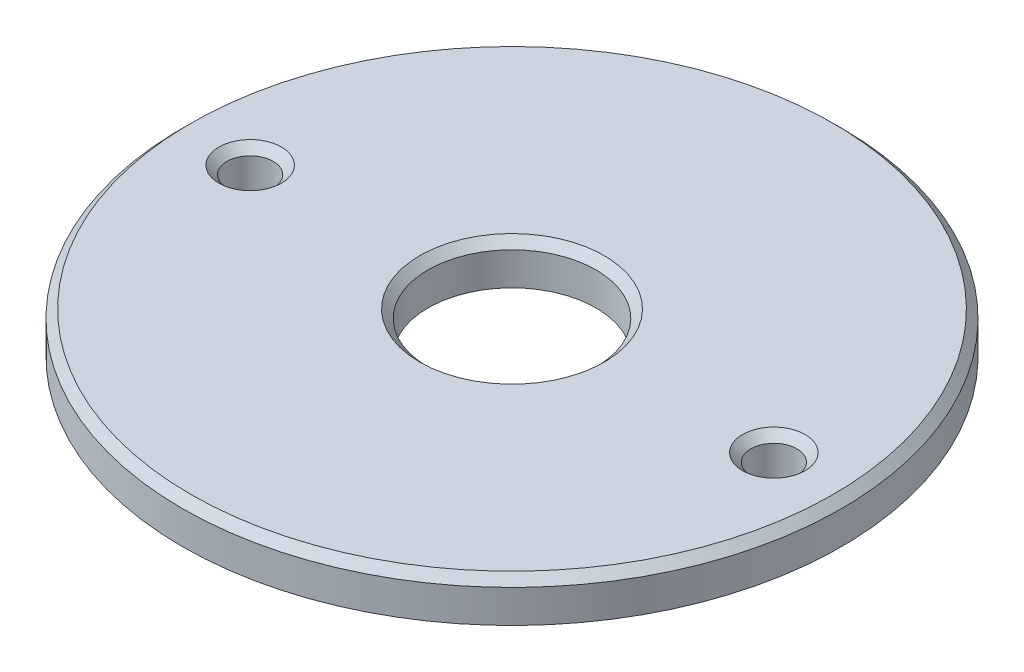
ISO-10303-21;
HEADER;
FILE_DESCRIPTION(('STEP AP214'),'2;1');
FILE_NAME('part.step','',(''),(''),'','','');
FILE_SCHEMA(('AUTOMOTIVE_DESIGN { 1 0 10303 214 1 1 1 1 }'));
ENDSEC;
DATA;
#1=APPLICATION_CONTEXT('core data for automotive mechanical design processes');
#2=APPLICATION_PROTOCOL_DEFINITION('international standard','automotive_design',2000,#1);
#3=PRODUCT_CONTEXT('',#1,'mechanical');
#4=PRODUCT('Part','Part','',(#3));
#5=PRODUCT_RELATED_PRODUCT_CATEGORY('part','',(#4));
#6=PRODUCT_DEFINITION_FORMATION('','',#4);
#7=PRODUCT_DEFINITION_CONTEXT('part definition',#1,'design');
#8=PRODUCT_DEFINITION('design','',#6,#7);
#9=PRODUCT_DEFINITION_SHAPE('','',#8);
#10=(LENGTH_UNIT() NAMED_UNIT(*) SI_UNIT(.MILLI.,.METRE.));
#11=(NAMED_UNIT(*) PLANE_ANGLE_UNIT() SI_UNIT($,.RADIAN.));
#12=(NAMED_UNIT(*) SI_UNIT($,.STERADIAN.) SOLID_ANGLE_UNIT());
#13=UNCERTAINTY_MEASURE_WITH_UNIT(LENGTH_MEASURE(1.E-05),#10,'distance_accuracy_value','');
#14=(GEOMETRIC_REPRESENTATION_CONTEXT(3) GLOBAL_UNCERTAINTY_ASSIGNED_CONTEXT((#13)) GLOBAL_UNIT_ASSIGNED_CONTEXT((#10,
#11,#12)) REPRESENTATION_CONTEXT('',''));
#15=CARTESIAN_POINT('',(0.,0.,0.));
#16=DIRECTION('',(0.,0.,1.));
#17=DIRECTION('',(1.,0.,0.));
#18=AXIS2_PLACEMENT_3D('',#15,#16,#17);
#19=CARTESIAN_POINT('',(0.,6.35,0.));
#20=DIRECTION('',(0.,1.,0.));
#21=DIRECTION('',(0.,0.,1.));
#22=AXIS2_PLACEMENT_3D('',#19,#20,#21);
#23=PLANE('',#22);
#24=CARTESIAN_POINT('',(39.37,6.35,-0.992258714812856));
#25=DIRECTION('',(0.,1.,0.));
#26=DIRECTION('',(0.,0.,1.));
#27=AXIS2_PLACEMENT_3D('',#24,#25,#26);
#28=CIRCLE('',#27,4.826);
#29=CARTESIAN_POINT('',(39.37,6.35,3.83374128518714));
#30=VERTEX_POINT('',#29);
#31=EDGE_CURVE('E57',#30,#30,#28,.F.);
#32=ORIENTED_EDGE('',*,*,#31,.T.);
#33=EDGE_LOOP('',(#32));
#34=FACE_BOUND('',#33,.T.);
#35=CARTESIAN_POINT('',(0.,6.35,0.));
#36=DIRECTION('',(0.,1.,0.));
#37=DIRECTION('',(0.,0.,1.));
#38=AXIS2_PLACEMENT_3D('',#35,#36,#37);
#39=CIRCLE('',#38,14.224);
#40=CARTESIAN_POINT('',(0.,6.35,14.224));
#41=VERTEX_POINT('',#40);
#42=EDGE_CURVE('E62',#41,#41,#39,.F.);
#43=ORIENTED_EDGE('',*,*,#42,.T.);
#44=EDGE_LOOP('',(#43));
#45=FACE_BOUND('',#44,.T.);
#46=CARTESIAN_POINT('',(0.,6.35,0.));
#47=DIRECTION('',(0.,1.,0.));
#48=DIRECTION('',(0.,0.,1.));
#49=AXIS2_PLACEMENT_3D('',#46,#47,#48);
#50=CIRCLE('',#49,49.53);
#51=CARTESIAN_POINT('',(0.,6.35,49.53));
#52=VERTEX_POINT('',#51);
#53=EDGE_CURVE('E65',#52,#52,#50,.T.);
#54=ORIENTED_EDGE('',*,*,#53,.T.);
#55=EDGE_LOOP('',(#54));
#56=FACE_BOUND('',#55,.T.);
#57=CARTESIAN_POINT('',(-39.37,6.35,0.992258714812856));
#58=DIRECTION('',(0.,1.,0.));
#59=DIRECTION('',(0.,0.,1.));
#60=AXIS2_PLACEMENT_3D('',#57,#58,#59);
#61=CIRCLE('',#60,4.82600000000001);
#62=CARTESIAN_POINT('',(-39.37,6.35,5.81825871481287));
#63=VERTEX_POINT('',#62);
#64=EDGE_CURVE('E68',#63,#63,#61,.F.);
#65=ORIENTED_EDGE('',*,*,#64,.T.);
#66=EDGE_LOOP('',(#65));
#67=FACE_BOUND('',#66,.T.);
#68=ADVANCED_FACE('F41',(#34,#45,#56,#67),#23,.T.);
#69=CARTESIAN_POINT('',(0.,0.,0.));
#70=DIRECTION('',(0.,1.,0.));
#71=DIRECTION('',(0.,0.,1.));
#72=AXIS2_PLACEMENT_3D('',#69,#70,#71);
#73=PLANE('',#72);
#74=CARTESIAN_POINT('',(0.,0.,0.));
#75=DIRECTION('',(0.,1.,0.));
#76=DIRECTION('',(0.,0.,1.));
#77=AXIS2_PLACEMENT_3D('',#74,#75,#76);
#78=CIRCLE('',#77,50.8);
#79=CARTESIAN_POINT('',(0.,0.,50.8));
#80=VERTEX_POINT('',#79);
#81=EDGE_CURVE('E74',#80,#80,#78,.T.);
#82=ORIENTED_EDGE('',*,*,#81,.F.);
#83=EDGE_LOOP('',(#82));
#84=FACE_BOUND('',#83,.T.);
#85=CARTESIAN_POINT('',(-39.37,0.,0.992258714812856));
#86=DIRECTION('',(0.,1.,0.));
#87=DIRECTION('',(0.,0.,1.));
#88=AXIS2_PLACEMENT_3D('',#85,#86,#87);
#89=CIRCLE('',#88,3.556);
#90=CARTESIAN_POINT('',(-39.37,0.,4.54825871481286));
#91=VERTEX_POINT('',#90);
#92=EDGE_CURVE('E77',#91,#91,#89,.T.);
#93=ORIENTED_EDGE('',*,*,#92,.T.);
#94=EDGE_LOOP('',(#93));
#95=FACE_BOUND('',#94,.T.);
#96=CARTESIAN_POINT('',(0.,0.,0.));
#97=DIRECTION('',(0.,1.,0.));
#98=DIRECTION('',(0.,0.,1.));
#99=AXIS2_PLACEMENT_3D('',#96,#97,#98);
#100=CIRCLE('',#99,12.954);
#101=CARTESIAN_POINT('',(0.,0.,12.954));
#102=VERTEX_POINT('',#101);
#103=EDGE_CURVE('E80',#102,#102,#100,.T.);
#104=ORIENTED_EDGE('',*,*,#103,.T.);
#105=EDGE_LOOP('',(#104));
#106=FACE_BOUND('',#105,.T.);
#107=CARTESIAN_POINT('',(39.37,0.,-0.992258714812856));
#108=DIRECTION('',(0.,1.,0.));
#109=DIRECTION('',(0.,0.,1.));
#110=AXIS2_PLACEMENT_3D('',#107,#108,#109);
#111=CIRCLE('',#110,3.55600000000001);
#112=CARTESIAN_POINT('',(39.37,0.,2.56374128518715));
#113=VERTEX_POINT('',#112);
#114=EDGE_CURVE('E83',#113,#113,#111,.T.);
#115=ORIENTED_EDGE('',*,*,#114,.T.);
#116=EDGE_LOOP('',(#115));
#117=FACE_BOUND('',#116,.T.);
#118=ADVANCED_FACE('F87',(#84,#95,#106,#117),#73,.F.);
#119=CARTESIAN_POINT('',(0.,6.35,0.));
#120=DIRECTION('',(0.,-1.,0.));
#121=DIRECTION('',(0.,0.,-1.));
#122=AXIS2_PLACEMENT_3D('',#119,#120,#121);
#123=CYLINDRICAL_SURFACE('',#122,50.8);
#124=CARTESIAN_POINT('',(0.,5.08000000000003,0.));
#125=DIRECTION('',(0.,1.,0.));
#126=DIRECTION('',(0.,0.,1.));
#127=AXIS2_PLACEMENT_3D('',#124,#125,#126);
#128=CIRCLE('',#127,50.8);
#129=CARTESIAN_POINT('',(0.,5.08000000000003,50.8));
#130=VERTEX_POINT('',#129);
#131=EDGE_CURVE('E49',#130,#130,#128,.F.);
#132=ORIENTED_EDGE('',*,*,#131,.T.);
#133=EDGE_LOOP('',(#132));
#134=FACE_BOUND('',#133,.T.);
#135=ORIENTED_EDGE('',*,*,#81,.T.);
#136=EDGE_LOOP('',(#135));
#137=FACE_BOUND('',#136,.T.);
#138=ADVANCED_FACE('F111',(#134,#137),#123,.T.);
#139=CARTESIAN_POINT('',(-39.37,6.35,0.992258714812856));
#140=DIRECTION('',(0.,-1.,0.));
#141=DIRECTION('',(0.,0.,-1.));
#142=AXIS2_PLACEMENT_3D('',#139,#140,#141);
#143=CYLINDRICAL_SURFACE('',#142,3.556);
#144=CARTESIAN_POINT('',(-39.37,5.07999999999999,0.992258714812856));
#145=DIRECTION('',(0.,1.,0.));
#146=DIRECTION('',(0.,0.,1.));
#147=AXIS2_PLACEMENT_3D('',#144,#145,#146);
#148=CIRCLE('',#147,3.556);
#149=CARTESIAN_POINT('',(-39.37,5.07999999999999,4.54825871481286));
#150=VERTEX_POINT('',#149);
#151=EDGE_CURVE('E10',#150,#150,#148,.T.);
#152=ORIENTED_EDGE('',*,*,#151,.T.);
#153=EDGE_LOOP('',(#152));
#154=FACE_BOUND('',#153,.T.);
#155=ORIENTED_EDGE('',*,*,#92,.F.);
#156=EDGE_LOOP('',(#155));
#157=FACE_BOUND('',#156,.T.);
#158=ADVANCED_FACE('F102',(#154,#157),#143,.F.);
#159=CARTESIAN_POINT('',(0.,6.35,0.));
#160=DIRECTION('',(0.,-1.,0.));
#161=DIRECTION('',(0.,0.,-1.));
#162=AXIS2_PLACEMENT_3D('',#159,#160,#161);
#163=CYLINDRICAL_SURFACE('',#162,12.954);
#164=CARTESIAN_POINT('',(0.,5.08000000000001,0.));
#165=DIRECTION('',(0.,1.,0.));
#166=DIRECTION('',(0.,0.,1.));
#167=AXIS2_PLACEMENT_3D('',#164,#165,#166);
#168=CIRCLE('',#167,12.954);
#169=CARTESIAN_POINT('',(0.,5.08000000000001,12.954));
#170=VERTEX_POINT('',#169);
#171=EDGE_CURVE('E53',#170,#170,#168,.T.);
#172=ORIENTED_EDGE('',*,*,#171,.T.);
#173=EDGE_LOOP('',(#172));
#174=FACE_BOUND('',#173,.T.);
#175=ORIENTED_EDGE('',*,*,#103,.F.);
#176=EDGE_LOOP('',(#175));
#177=FACE_BOUND('',#176,.T.);
#178=ADVANCED_FACE('F92',(#174,#177),#163,.F.);
#179=CARTESIAN_POINT('',(39.37,6.35,-0.992258714812856));
#180=DIRECTION('',(0.,-1.,0.));
#181=DIRECTION('',(0.,0.,-1.));
#182=AXIS2_PLACEMENT_3D('',#179,#180,#181);
#183=CYLINDRICAL_SURFACE('',#182,3.55600000000001);
#184=CARTESIAN_POINT('',(39.37,5.08000000000001,-0.992258714812856));
#185=DIRECTION('',(0.,1.,0.));
#186=DIRECTION('',(0.,0.,1.));
#187=AXIS2_PLACEMENT_3D('',#184,#185,#186);
#188=CIRCLE('',#187,3.55600000000001);
#189=CARTESIAN_POINT('',(39.37,5.08000000000001,2.56374128518715));
#190=VERTEX_POINT('',#189);
#191=EDGE_CURVE('E71',#190,#190,#188,.T.);
#192=ORIENTED_EDGE('',*,*,#191,.T.);
#193=EDGE_LOOP('',(#192));
#194=FACE_BOUND('',#193,.T.);
#195=ORIENTED_EDGE('',*,*,#114,.F.);
#196=EDGE_LOOP('',(#195));
#197=FACE_BOUND('',#196,.T.);
#198=ADVANCED_FACE('F89',(#194,#197),#183,.F.);
#199=CARTESIAN_POINT('',(39.37,5.08000000000001,-0.992258714812856));
#200=DIRECTION('',(0.,1.,0.));
#201=DIRECTION('',(0.,0.,1.));
#202=AXIS2_PLACEMENT_3D('',#199,#200,#201);
#203=CONICAL_SURFACE('',#202,3.55600000000001,0.785398163397448);
#204=ORIENTED_EDGE('',*,*,#31,.F.);
#205=EDGE_LOOP('',(#204));
#206=FACE_BOUND('',#205,.T.);
#207=ORIENTED_EDGE('',*,*,#191,.F.);
#208=EDGE_LOOP('',(#207));
#209=FACE_BOUND('',#208,.T.);
#210=ADVANCED_FACE('F91',(#206,#209),#203,.F.);
#211=CARTESIAN_POINT('',(0.,5.08000000000001,0.));
#212=DIRECTION('',(0.,1.,0.));
#213=DIRECTION('',(0.,0.,1.));
#214=AXIS2_PLACEMENT_3D('',#211,#212,#213);
#215=CONICAL_SURFACE('',#214,12.954,0.785398163397447);
#216=ORIENTED_EDGE('',*,*,#42,.F.);
#217=EDGE_LOOP('',(#216));
#218=FACE_BOUND('',#217,.T.);
#219=ORIENTED_EDGE('',*,*,#171,.F.);
#220=EDGE_LOOP('',(#219));
#221=FACE_BOUND('',#220,.T.);
#222=ADVANCED_FACE('F99',(#218,#221),#215,.F.);
#223=CARTESIAN_POINT('',(0.,6.35,0.));
#224=DIRECTION('',(0.,-1.,0.));
#225=DIRECTION('',(0.,0.,-1.));
#226=AXIS2_PLACEMENT_3D('',#223,#224,#225);
#227=CONICAL_SURFACE('',#226,49.53,0.78539816339744);
#228=ORIENTED_EDGE('',*,*,#131,.F.);
#229=EDGE_LOOP('',(#228));
#230=FACE_BOUND('',#229,.T.);
#231=ORIENTED_EDGE('',*,*,#53,.F.);
#232=EDGE_LOOP('',(#231));
#233=FACE_BOUND('',#232,.T.);
#234=ADVANCED_FACE('F127',(#230,#233),#227,.T.);
#235=CARTESIAN_POINT('',(-39.37,5.07999999999999,0.992258714812856));
#236=DIRECTION('',(0.,1.,0.));
#237=DIRECTION('',(0.,0.,1.));
#238=AXIS2_PLACEMENT_3D('',#235,#236,#237);
#239=CONICAL_SURFACE('',#238,3.556,0.785398163397449);
#240=ORIENTED_EDGE('',*,*,#64,.F.);
#241=EDGE_LOOP('',(#240));
#242=FACE_BOUND('',#241,.T.);
#243=ORIENTED_EDGE('',*,*,#151,.F.);
#244=EDGE_LOOP('',(#243));
#245=FACE_BOUND('',#244,.T.);
#246=ADVANCED_FACE('F44',(#242,#245),#239,.F.);
#247=CLOSED_SHELL('',(#68,#118,#138,#158,#178,#198,#210,#222,#234,#246));
#248=MANIFOLD_SOLID_BREP('B2',#247);
#249=ADVANCED_BREP_SHAPE_REPRESENTATION('',(#18,#248),#14);
#250=SHAPE_DEFINITION_REPRESENTATION(#9,#249);
ENDSEC;
END-ISO-10303-21;
